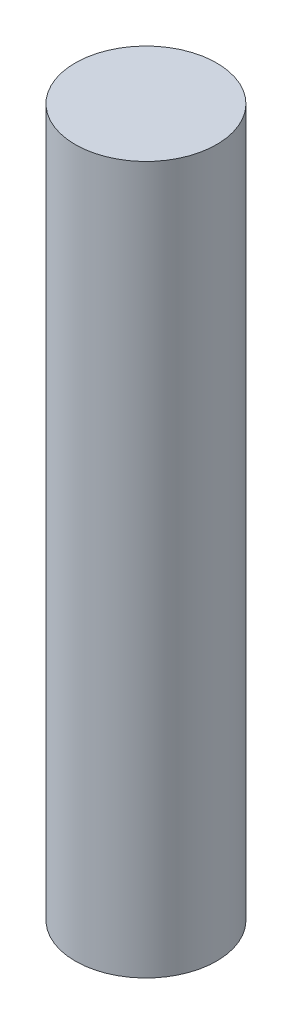
ISO-10303-21;
HEADER;
FILE_DESCRIPTION(('STEP AP214'),'2;1');
FILE_NAME('part.step','',(''),(''),'','','');
FILE_SCHEMA(('AUTOMOTIVE_DESIGN { 1 0 10303 214 1 1 1 1 }'));
ENDSEC;
DATA;
#1=APPLICATION_CONTEXT('core data for automotive mechanical design processes');
#2=APPLICATION_PROTOCOL_DEFINITION('international standard','automotive_design',2000,#1);
#3=PRODUCT_CONTEXT('',#1,'mechanical');
#4=PRODUCT('Part','Part','',(#3));
#5=PRODUCT_RELATED_PRODUCT_CATEGORY('part','',(#4));
#6=PRODUCT_DEFINITION_FORMATION('','',#4);
#7=PRODUCT_DEFINITION_CONTEXT('part definition',#1,'design');
#8=PRODUCT_DEFINITION('design','',#6,#7);
#9=PRODUCT_DEFINITION_SHAPE('','',#8);
#10=(LENGTH_UNIT() NAMED_UNIT(*) SI_UNIT(.MILLI.,.METRE.));
#11=(NAMED_UNIT(*) PLANE_ANGLE_UNIT() SI_UNIT($,.RADIAN.));
#12=(NAMED_UNIT(*) SI_UNIT($,.STERADIAN.) SOLID_ANGLE_UNIT());
#13=UNCERTAINTY_MEASURE_WITH_UNIT(LENGTH_MEASURE(1.E-05),#10,'distance_accuracy_value','');
#14=(GEOMETRIC_REPRESENTATION_CONTEXT(3) GLOBAL_UNCERTAINTY_ASSIGNED_CONTEXT((#13)) GLOBAL_UNIT_ASSIGNED_CONTEXT((#10,
#11,#12)) REPRESENTATION_CONTEXT('',''));
#15=CARTESIAN_POINT('',(0.,0.,0.));
#16=DIRECTION('',(0.,0.,1.));
#17=DIRECTION('',(1.,0.,0.));
#18=AXIS2_PLACEMENT_3D('',#15,#16,#17);
#19=CARTESIAN_POINT('',(0.,22.86,0.));
#20=DIRECTION('',(0.,-1.,0.));
#21=DIRECTION('',(0.,0.,-1.));
#22=AXIS2_PLACEMENT_3D('',#19,#20,#21);
#23=CYLINDRICAL_SURFACE('',#22,2.286);
#24=CARTESIAN_POINT('',(0.,22.86,0.));
#25=DIRECTION('',(0.,1.,0.));
#26=DIRECTION('',(0.,0.,1.));
#27=AXIS2_PLACEMENT_3D('',#24,#25,#26);
#28=CIRCLE('',#27,2.286);
#29=CARTESIAN_POINT('',(0.,22.86,2.286));
#30=VERTEX_POINT('',#29);
#31=EDGE_CURVE('E10',#30,#30,#28,.T.);
#32=ORIENTED_EDGE('',*,*,#31,.F.);
#33=EDGE_LOOP('',(#32));
#34=FACE_BOUND('',#33,.T.);
#35=CARTESIAN_POINT('',(0.,0.,0.));
#36=DIRECTION('',(0.,1.,0.));
#37=DIRECTION('',(0.,0.,1.));
#38=AXIS2_PLACEMENT_3D('',#35,#36,#37);
#39=CIRCLE('',#38,2.286);
#40=CARTESIAN_POINT('',(0.,0.,2.286));
#41=VERTEX_POINT('',#40);
#42=EDGE_CURVE('E34',#41,#41,#39,.T.);
#43=ORIENTED_EDGE('',*,*,#42,.T.);
#44=EDGE_LOOP('',(#43));
#45=FACE_BOUND('',#44,.T.);
#46=ADVANCED_FACE('F31',(#34,#45),#23,.T.);
#47=CARTESIAN_POINT('',(0.,22.86,0.));
#48=DIRECTION('',(0.,1.,0.));
#49=DIRECTION('',(0.,0.,1.));
#50=AXIS2_PLACEMENT_3D('',#47,#48,#49);
#51=PLANE('',#50);
#52=ORIENTED_EDGE('',*,*,#31,.T.);
#53=EDGE_LOOP('',(#52));
#54=FACE_BOUND('',#53,.T.);
#55=ADVANCED_FACE('F46',(#54),#51,.T.);
#56=CARTESIAN_POINT('',(0.,0.,0.));
#57=DIRECTION('',(0.,1.,0.));
#58=DIRECTION('',(0.,0.,1.));
#59=AXIS2_PLACEMENT_3D('',#56,#57,#58);
#60=PLANE('',#59);
#61=ORIENTED_EDGE('',*,*,#42,.F.);
#62=EDGE_LOOP('',(#61));
#63=FACE_BOUND('',#62,.T.);
#64=ADVANCED_FACE('F44',(#63),#60,.F.);
#65=CLOSED_SHELL('',(#46,#55,#64));
#66=MANIFOLD_SOLID_BREP('B2',#65);
#67=ADVANCED_BREP_SHAPE_REPRESENTATION('',(#18,#66),#14);
#68=SHAPE_DEFINITION_REPRESENTATION(#9,#67);
ENDSEC;
END-ISO-10303-21;
